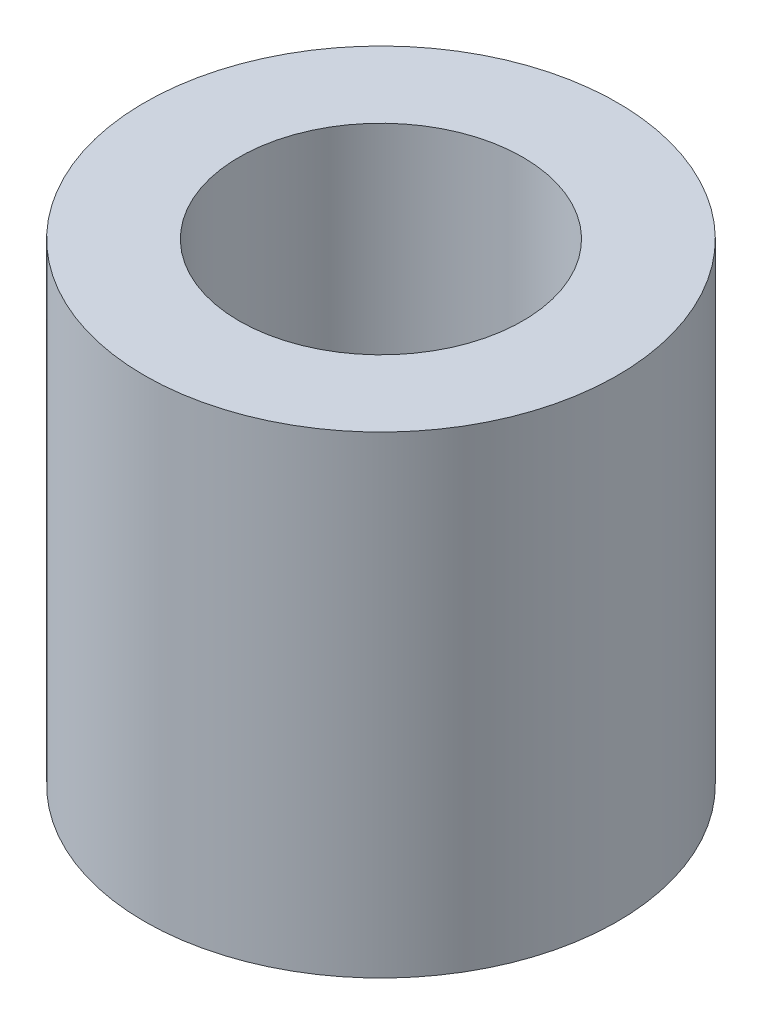
ISO-10303-21;
HEADER;
FILE_DESCRIPTION(('STEP AP214'),'2;1');
FILE_NAME('part.step','',(''),(''),'','','');
FILE_SCHEMA(('AUTOMOTIVE_DESIGN { 1 0 10303 214 1 1 1 1 }'));
ENDSEC;
DATA;
#1=APPLICATION_CONTEXT('core data for automotive mechanical design processes');
#2=APPLICATION_PROTOCOL_DEFINITION('international standard','automotive_design',2000,#1);
#3=PRODUCT_CONTEXT('',#1,'mechanical');
#4=PRODUCT('Part','Part','',(#3));
#5=PRODUCT_RELATED_PRODUCT_CATEGORY('part','',(#4));
#6=PRODUCT_DEFINITION_FORMATION('','',#4);
#7=PRODUCT_DEFINITION_CONTEXT('part definition',#1,'design');
#8=PRODUCT_DEFINITION('design','',#6,#7);
#9=PRODUCT_DEFINITION_SHAPE('','',#8);
#10=(LENGTH_UNIT() NAMED_UNIT(*) SI_UNIT(.MILLI.,.METRE.));
#11=(NAMED_UNIT(*) PLANE_ANGLE_UNIT() SI_UNIT($,.RADIAN.));
#12=(NAMED_UNIT(*) SI_UNIT($,.STERADIAN.) SOLID_ANGLE_UNIT());
#13=UNCERTAINTY_MEASURE_WITH_UNIT(LENGTH_MEASURE(1.E-05),#10,'distance_accuracy_value','');
#14=(GEOMETRIC_REPRESENTATION_CONTEXT(3) GLOBAL_UNCERTAINTY_ASSIGNED_CONTEXT((#13)) GLOBAL_UNIT_ASSIGNED_CONTEXT((#10,
#11,#12)) REPRESENTATION_CONTEXT('',''));
#15=CARTESIAN_POINT('',(0.,0.,0.));
#16=DIRECTION('',(0.,0.,1.));
#17=DIRECTION('',(1.,0.,0.));
#18=AXIS2_PLACEMENT_3D('',#15,#16,#17);
#19=CARTESIAN_POINT('',(0.,5.,0.));
#20=DIRECTION('',(0.,1.,0.));
#21=DIRECTION('',(0.,0.,1.));
#22=AXIS2_PLACEMENT_3D('',#19,#20,#21);
#23=PLANE('',#22);
#24=CARTESIAN_POINT('',(0.,5.,0.));
#25=DIRECTION('',(0.,1.,0.));
#26=DIRECTION('',(0.,0.,1.));
#27=AXIS2_PLACEMENT_3D('',#24,#25,#26);
#28=CIRCLE('',#27,2.5);
#29=CARTESIAN_POINT('',(0.,5.,2.5));
#30=VERTEX_POINT('',#29);
#31=EDGE_CURVE('E10',#30,#30,#28,.T.);
#32=ORIENTED_EDGE('',*,*,#31,.T.);
#33=EDGE_LOOP('',(#32));
#34=FACE_BOUND('',#33,.T.);
#35=CARTESIAN_POINT('',(0.,5.,0.));
#36=DIRECTION('',(0.,1.,0.));
#37=DIRECTION('',(0.,0.,1.));
#38=AXIS2_PLACEMENT_3D('',#35,#36,#37);
#39=CIRCLE('',#38,1.5);
#40=CARTESIAN_POINT('',(0.,5.,1.5));
#41=VERTEX_POINT('',#40);
#42=EDGE_CURVE('E42',#41,#41,#39,.T.);
#43=ORIENTED_EDGE('',*,*,#42,.F.);
#44=EDGE_LOOP('',(#43));
#45=FACE_BOUND('',#44,.T.);
#46=ADVANCED_FACE('F31',(#34,#45),#23,.T.);
#47=CARTESIAN_POINT('',(0.,0.,0.));
#48=DIRECTION('',(0.,1.,0.));
#49=DIRECTION('',(0.,0.,1.));
#50=AXIS2_PLACEMENT_3D('',#47,#48,#49);
#51=PLANE('',#50);
#52=CARTESIAN_POINT('',(0.,0.,0.));
#53=DIRECTION('',(0.,1.,0.));
#54=DIRECTION('',(0.,0.,1.));
#55=AXIS2_PLACEMENT_3D('',#52,#53,#54);
#56=CIRCLE('',#55,2.5);
#57=CARTESIAN_POINT('',(0.,0.,2.5));
#58=VERTEX_POINT('',#57);
#59=EDGE_CURVE('E35',#58,#58,#56,.T.);
#60=ORIENTED_EDGE('',*,*,#59,.F.);
#61=EDGE_LOOP('',(#60));
#62=FACE_BOUND('',#61,.T.);
#63=CARTESIAN_POINT('',(0.,0.,0.));
#64=DIRECTION('',(0.,1.,0.));
#65=DIRECTION('',(0.,0.,1.));
#66=AXIS2_PLACEMENT_3D('',#63,#64,#65);
#67=CIRCLE('',#66,1.5);
#68=CARTESIAN_POINT('',(0.,0.,1.5));
#69=VERTEX_POINT('',#68);
#70=EDGE_CURVE('E44',#69,#69,#67,.T.);
#71=ORIENTED_EDGE('',*,*,#70,.T.);
#72=EDGE_LOOP('',(#71));
#73=FACE_BOUND('',#72,.T.);
#74=ADVANCED_FACE('F54',(#62,#73),#51,.F.);
#75=CARTESIAN_POINT('',(0.,5.,0.));
#76=DIRECTION('',(0.,-1.,0.));
#77=DIRECTION('',(0.,0.,-1.));
#78=AXIS2_PLACEMENT_3D('',#75,#76,#77);
#79=CYLINDRICAL_SURFACE('',#78,2.5);
#80=ORIENTED_EDGE('',*,*,#31,.F.);
#81=EDGE_LOOP('',(#80));
#82=FACE_BOUND('',#81,.T.);
#83=ORIENTED_EDGE('',*,*,#59,.T.);
#84=EDGE_LOOP('',(#83));
#85=FACE_BOUND('',#84,.T.);
#86=ADVANCED_FACE('F33',(#82,#85),#79,.T.);
#87=CARTESIAN_POINT('',(0.,5.,0.));
#88=DIRECTION('',(0.,-1.,0.));
#89=DIRECTION('',(0.,0.,-1.));
#90=AXIS2_PLACEMENT_3D('',#87,#88,#89);
#91=CYLINDRICAL_SURFACE('',#90,1.5);
#92=ORIENTED_EDGE('',*,*,#42,.T.);
#93=EDGE_LOOP('',(#92));
#94=FACE_BOUND('',#93,.T.);
#95=ORIENTED_EDGE('',*,*,#70,.F.);
#96=EDGE_LOOP('',(#95));
#97=FACE_BOUND('',#96,.T.);
#98=ADVANCED_FACE('F50',(#94,#97),#91,.F.);
#99=CLOSED_SHELL('',(#46,#74,#86,#98));
#100=MANIFOLD_SOLID_BREP('B2',#99);
#101=ADVANCED_BREP_SHAPE_REPRESENTATION('',(#18,#100),#14);
#102=SHAPE_DEFINITION_REPRESENTATION(#9,#101);
ENDSEC;
END-ISO-10303-21;
